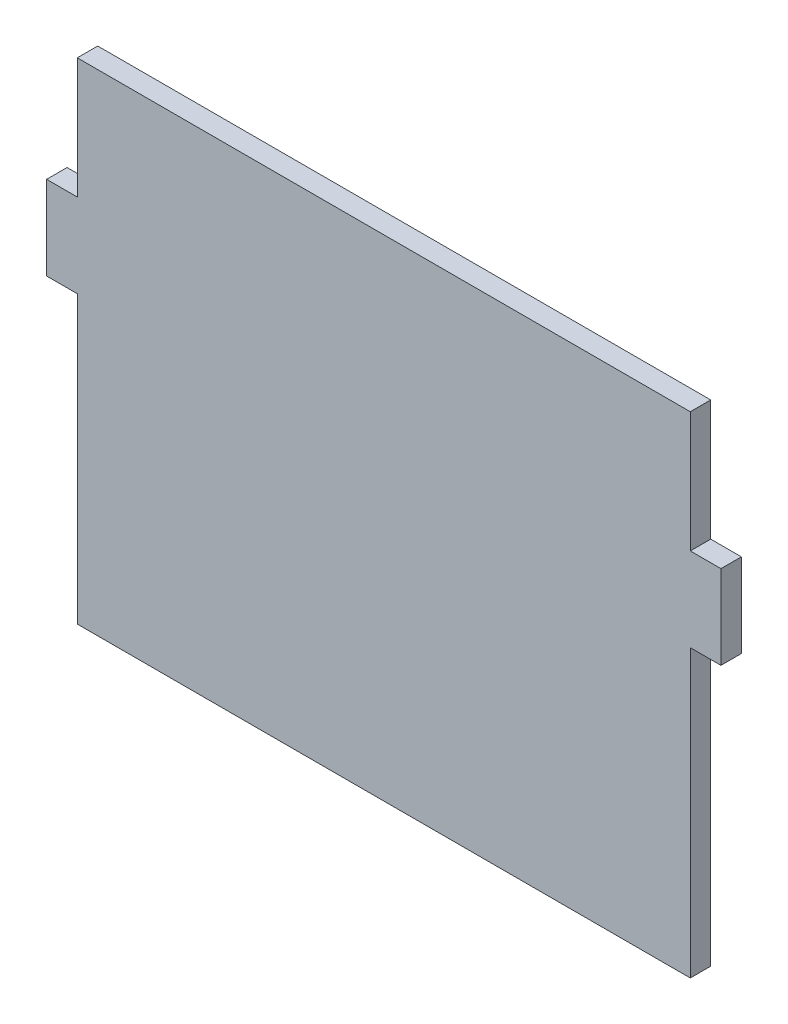
ISO-10303-21;
HEADER;
FILE_DESCRIPTION(('STEP AP214'),'2;1');
FILE_NAME('part.step','',(''),(''),'','','');
FILE_SCHEMA(('AUTOMOTIVE_DESIGN { 1 0 10303 214 1 1 1 1 }'));
ENDSEC;
DATA;
#1=APPLICATION_CONTEXT('core data for automotive mechanical design processes');
#2=APPLICATION_PROTOCOL_DEFINITION('international standard','automotive_design',2000,#1);
#3=PRODUCT_CONTEXT('',#1,'mechanical');
#4=PRODUCT('Part','Part','',(#3));
#5=PRODUCT_RELATED_PRODUCT_CATEGORY('part','',(#4));
#6=PRODUCT_DEFINITION_FORMATION('','',#4);
#7=PRODUCT_DEFINITION_CONTEXT('part definition',#1,'design');
#8=PRODUCT_DEFINITION('design','',#6,#7);
#9=PRODUCT_DEFINITION_SHAPE('','',#8);
#10=(LENGTH_UNIT() NAMED_UNIT(*) SI_UNIT(.MILLI.,.METRE.));
#11=(NAMED_UNIT(*) PLANE_ANGLE_UNIT() SI_UNIT($,.RADIAN.));
#12=(NAMED_UNIT(*) SI_UNIT($,.STERADIAN.) SOLID_ANGLE_UNIT());
#13=UNCERTAINTY_MEASURE_WITH_UNIT(LENGTH_MEASURE(1.E-05),#10,'distance_accuracy_value','');
#14=(GEOMETRIC_REPRESENTATION_CONTEXT(3) GLOBAL_UNCERTAINTY_ASSIGNED_CONTEXT((#13)) GLOBAL_UNIT_ASSIGNED_CONTEXT((#10,
#11,#12)) REPRESENTATION_CONTEXT('',''));
#15=CARTESIAN_POINT('',(0.,0.,0.));
#16=DIRECTION('',(0.,0.,1.));
#17=DIRECTION('',(1.,0.,0.));
#18=AXIS2_PLACEMENT_3D('',#15,#16,#17);
#19=CARTESIAN_POINT('',(150.,120.,10.));
#20=DIRECTION('',(-1.,0.,0.));
#21=DIRECTION('',(0.,-1.,0.));
#22=AXIS2_PLACEMENT_3D('',#19,#20,#21);
#23=PLANE('',#22);
#24=DIRECTION('',(0.,1.,0.));
#25=VECTOR('',#24,1.);
#26=CARTESIAN_POINT('',(150.,120.,0.));
#27=LINE('',#26,#25);
#28=CARTESIAN_POINT('',(150.,61.,0.));
#29=VERTEX_POINT('',#28);
#30=CARTESIAN_POINT('',(150.,120.,0.));
#31=VERTEX_POINT('',#30);
#32=EDGE_CURVE('E154',#29,#31,#27,.T.);
#33=ORIENTED_EDGE('',*,*,#32,.T.);
#34=DIRECTION('',(0.,0.,-1.));
#35=VECTOR('',#34,1.);
#36=CARTESIAN_POINT('',(150.,120.,10.));
#37=LINE('',#36,#35);
#38=CARTESIAN_POINT('',(150.,120.,10.));
#39=VERTEX_POINT('',#38);
#40=EDGE_CURVE('E11',#39,#31,#37,.T.);
#41=ORIENTED_EDGE('',*,*,#40,.F.);
#42=DIRECTION('',(0.,1.,0.));
#43=VECTOR('',#42,1.);
#44=CARTESIAN_POINT('',(150.,120.,10.));
#45=LINE('',#44,#43);
#46=CARTESIAN_POINT('',(150.,61.,10.));
#47=VERTEX_POINT('',#46);
#48=EDGE_CURVE('E176',#47,#39,#45,.T.);
#49=ORIENTED_EDGE('',*,*,#48,.F.);
#50=DIRECTION('',(0.,0.,-1.));
#51=VECTOR('',#50,1.);
#52=CARTESIAN_POINT('',(150.,61.,10.));
#53=LINE('',#52,#51);
#54=EDGE_CURVE('E150',#47,#29,#53,.T.);
#55=ORIENTED_EDGE('',*,*,#54,.T.);
#56=EDGE_LOOP('',(#33,#41,#49,#55));
#57=FACE_BOUND('',#56,.T.);
#58=ADVANCED_FACE('F34',(#57),#23,.F.);
#59=CARTESIAN_POINT('',(-150.,120.,10.));
#60=DIRECTION('',(0.,-1.,0.));
#61=DIRECTION('',(0.,0.,-1.));
#62=AXIS2_PLACEMENT_3D('',#59,#60,#61);
#63=PLANE('',#62);
#64=DIRECTION('',(-1.,0.,0.));
#65=VECTOR('',#64,1.);
#66=CARTESIAN_POINT('',(-150.,120.,0.));
#67=LINE('',#66,#65);
#68=CARTESIAN_POINT('',(-150.,120.,0.));
#69=VERTEX_POINT('',#68);
#70=EDGE_CURVE('E157',#31,#69,#67,.T.);
#71=ORIENTED_EDGE('',*,*,#70,.T.);
#72=DIRECTION('',(0.,0.,-1.));
#73=VECTOR('',#72,1.);
#74=CARTESIAN_POINT('',(-150.,120.,10.));
#75=LINE('',#74,#73);
#76=CARTESIAN_POINT('',(-150.,120.,10.));
#77=VERTEX_POINT('',#76);
#78=EDGE_CURVE('E42',#77,#69,#75,.T.);
#79=ORIENTED_EDGE('',*,*,#78,.F.);
#80=DIRECTION('',(-1.,0.,0.));
#81=VECTOR('',#80,1.);
#82=CARTESIAN_POINT('',(-150.,120.,10.));
#83=LINE('',#82,#81);
#84=EDGE_CURVE('E105',#39,#77,#83,.T.);
#85=ORIENTED_EDGE('',*,*,#84,.F.);
#86=ORIENTED_EDGE('',*,*,#40,.T.);
#87=EDGE_LOOP('',(#71,#79,#85,#86));
#88=FACE_BOUND('',#87,.T.);
#89=ADVANCED_FACE('F254',(#88),#63,.F.);
#90=CARTESIAN_POINT('',(-150.,61.,10.));
#91=DIRECTION('',(1.,0.,0.));
#92=DIRECTION('',(0.,1.,0.));
#93=AXIS2_PLACEMENT_3D('',#90,#91,#92);
#94=PLANE('',#93);
#95=DIRECTION('',(0.,-1.,0.));
#96=VECTOR('',#95,1.);
#97=CARTESIAN_POINT('',(-150.,61.,0.));
#98=LINE('',#97,#96);
#99=CARTESIAN_POINT('',(-150.,61.,0.));
#100=VERTEX_POINT('',#99);
#101=EDGE_CURVE('E159',#69,#100,#98,.T.);
#102=ORIENTED_EDGE('',*,*,#101,.T.);
#103=DIRECTION('',(0.,0.,-1.));
#104=VECTOR('',#103,1.);
#105=CARTESIAN_POINT('',(-150.,61.,10.));
#106=LINE('',#105,#104);
#107=CARTESIAN_POINT('',(-150.,61.,10.));
#108=VERTEX_POINT('',#107);
#109=EDGE_CURVE('E195',#108,#100,#106,.T.);
#110=ORIENTED_EDGE('',*,*,#109,.F.);
#111=DIRECTION('',(0.,-1.,0.));
#112=VECTOR('',#111,1.);
#113=CARTESIAN_POINT('',(-150.,61.,10.));
#114=LINE('',#113,#112);
#115=EDGE_CURVE('E203',#77,#108,#114,.T.);
#116=ORIENTED_EDGE('',*,*,#115,.F.);
#117=ORIENTED_EDGE('',*,*,#78,.T.);
#118=EDGE_LOOP('',(#102,#110,#116,#117));
#119=FACE_BOUND('',#118,.T.);
#120=ADVANCED_FACE('F201',(#119),#94,.F.);
#121=CARTESIAN_POINT('',(-165.,61.,10.));
#122=DIRECTION('',(0.,-1.,0.));
#123=DIRECTION('',(0.,0.,-1.));
#124=AXIS2_PLACEMENT_3D('',#121,#122,#123);
#125=PLANE('',#124);
#126=DIRECTION('',(-1.,0.,0.));
#127=VECTOR('',#126,1.);
#128=CARTESIAN_POINT('',(-165.,61.,0.));
#129=LINE('',#128,#127);
#130=CARTESIAN_POINT('',(-165.,61.,0.));
#131=VERTEX_POINT('',#130);
#132=EDGE_CURVE('E161',#100,#131,#129,.T.);
#133=ORIENTED_EDGE('',*,*,#132,.T.);
#134=DIRECTION('',(0.,0.,-1.));
#135=VECTOR('',#134,1.);
#136=CARTESIAN_POINT('',(-165.,61.,10.));
#137=LINE('',#136,#135);
#138=CARTESIAN_POINT('',(-165.,61.,10.));
#139=VERTEX_POINT('',#138);
#140=EDGE_CURVE('E192',#139,#131,#137,.T.);
#141=ORIENTED_EDGE('',*,*,#140,.F.);
#142=DIRECTION('',(-1.,0.,0.));
#143=VECTOR('',#142,1.);
#144=CARTESIAN_POINT('',(-165.,61.,10.));
#145=LINE('',#144,#143);
#146=EDGE_CURVE('E221',#108,#139,#145,.T.);
#147=ORIENTED_EDGE('',*,*,#146,.F.);
#148=ORIENTED_EDGE('',*,*,#109,.T.);
#149=EDGE_LOOP('',(#133,#141,#147,#148));
#150=FACE_BOUND('',#149,.T.);
#151=ADVANCED_FACE('F212',(#150),#125,.F.);
#152=CARTESIAN_POINT('',(-165.,20.,10.));
#153=DIRECTION('',(1.,0.,0.));
#154=DIRECTION('',(0.,1.,0.));
#155=AXIS2_PLACEMENT_3D('',#152,#153,#154);
#156=PLANE('',#155);
#157=DIRECTION('',(0.,-1.,0.));
#158=VECTOR('',#157,1.);
#159=CARTESIAN_POINT('',(-165.,20.,0.));
#160=LINE('',#159,#158);
#161=CARTESIAN_POINT('',(-165.,20.,0.));
#162=VERTEX_POINT('',#161);
#163=EDGE_CURVE('E163',#131,#162,#160,.T.);
#164=ORIENTED_EDGE('',*,*,#163,.T.);
#165=DIRECTION('',(0.,0.,-1.));
#166=VECTOR('',#165,1.);
#167=CARTESIAN_POINT('',(-165.,20.,10.));
#168=LINE('',#167,#166);
#169=CARTESIAN_POINT('',(-165.,20.,10.));
#170=VERTEX_POINT('',#169);
#171=EDGE_CURVE('E189',#170,#162,#168,.T.);
#172=ORIENTED_EDGE('',*,*,#171,.F.);
#173=DIRECTION('',(0.,-1.,0.));
#174=VECTOR('',#173,1.);
#175=CARTESIAN_POINT('',(-165.,20.,10.));
#176=LINE('',#175,#174);
#177=EDGE_CURVE('E218',#139,#170,#176,.T.);
#178=ORIENTED_EDGE('',*,*,#177,.F.);
#179=ORIENTED_EDGE('',*,*,#140,.T.);
#180=EDGE_LOOP('',(#164,#172,#178,#179));
#181=FACE_BOUND('',#180,.T.);
#182=ADVANCED_FACE('F216',(#181),#156,.F.);
#183=CARTESIAN_POINT('',(-150.,20.,10.));
#184=DIRECTION('',(0.,1.,0.));
#185=DIRECTION('',(0.,0.,1.));
#186=AXIS2_PLACEMENT_3D('',#183,#184,#185);
#187=PLANE('',#186);
#188=DIRECTION('',(1.,0.,0.));
#189=VECTOR('',#188,1.);
#190=CARTESIAN_POINT('',(-150.,20.,0.));
#191=LINE('',#190,#189);
#192=CARTESIAN_POINT('',(-150.,20.,0.));
#193=VERTEX_POINT('',#192);
#194=EDGE_CURVE('E165',#162,#193,#191,.T.);
#195=ORIENTED_EDGE('',*,*,#194,.T.);
#196=DIRECTION('',(0.,0.,-1.));
#197=VECTOR('',#196,1.);
#198=CARTESIAN_POINT('',(-150.,20.,10.));
#199=LINE('',#198,#197);
#200=CARTESIAN_POINT('',(-150.,20.,10.));
#201=VERTEX_POINT('',#200);
#202=EDGE_CURVE('E186',#201,#193,#199,.T.);
#203=ORIENTED_EDGE('',*,*,#202,.F.);
#204=DIRECTION('',(1.,0.,0.));
#205=VECTOR('',#204,1.);
#206=CARTESIAN_POINT('',(-150.,20.,10.));
#207=LINE('',#206,#205);
#208=EDGE_CURVE('E220',#170,#201,#207,.T.);
#209=ORIENTED_EDGE('',*,*,#208,.F.);
#210=ORIENTED_EDGE('',*,*,#171,.T.);
#211=EDGE_LOOP('',(#195,#203,#209,#210));
#212=FACE_BOUND('',#211,.T.);
#213=ADVANCED_FACE('F267',(#212),#187,.F.);
#214=CARTESIAN_POINT('',(-150.,-120.,10.));
#215=DIRECTION('',(1.,0.,0.));
#216=DIRECTION('',(0.,0.,-1.));
#217=AXIS2_PLACEMENT_3D('',#214,#215,#216);
#218=PLANE('',#217);
#219=DIRECTION('',(0.,-1.,0.));
#220=VECTOR('',#219,1.);
#221=CARTESIAN_POINT('',(-150.,-120.,0.));
#222=LINE('',#221,#220);
#223=CARTESIAN_POINT('',(-150.,-120.,0.));
#224=VERTEX_POINT('',#223);
#225=EDGE_CURVE('E167',#193,#224,#222,.T.);
#226=ORIENTED_EDGE('',*,*,#225,.T.);
#227=DIRECTION('',(0.,0.,-1.));
#228=VECTOR('',#227,1.);
#229=CARTESIAN_POINT('',(-150.,-120.,10.));
#230=LINE('',#229,#228);
#231=CARTESIAN_POINT('',(-150.,-120.,10.));
#232=VERTEX_POINT('',#231);
#233=EDGE_CURVE('E183',#232,#224,#230,.T.);
#234=ORIENTED_EDGE('',*,*,#233,.F.);
#235=DIRECTION('',(0.,-1.,0.));
#236=VECTOR('',#235,1.);
#237=CARTESIAN_POINT('',(-150.,-120.,10.));
#238=LINE('',#237,#236);
#239=EDGE_CURVE('E223',#201,#232,#238,.T.);
#240=ORIENTED_EDGE('',*,*,#239,.F.);
#241=ORIENTED_EDGE('',*,*,#202,.T.);
#242=EDGE_LOOP('',(#226,#234,#240,#241));
#243=FACE_BOUND('',#242,.T.);
#244=ADVANCED_FACE('F270',(#243),#218,.F.);
#245=CARTESIAN_POINT('',(150.,-120.,10.));
#246=DIRECTION('',(0.,1.,0.));
#247=DIRECTION('',(0.,0.,1.));
#248=AXIS2_PLACEMENT_3D('',#245,#246,#247);
#249=PLANE('',#248);
#250=DIRECTION('',(1.,0.,0.));
#251=VECTOR('',#250,1.);
#252=CARTESIAN_POINT('',(150.,-120.,0.));
#253=LINE('',#252,#251);
#254=CARTESIAN_POINT('',(150.,-120.,0.));
#255=VERTEX_POINT('',#254);
#256=EDGE_CURVE('E169',#224,#255,#253,.T.);
#257=ORIENTED_EDGE('',*,*,#256,.T.);
#258=DIRECTION('',(0.,0.,-1.));
#259=VECTOR('',#258,1.);
#260=CARTESIAN_POINT('',(150.,-120.,10.));
#261=LINE('',#260,#259);
#262=CARTESIAN_POINT('',(150.,-120.,10.));
#263=VERTEX_POINT('',#262);
#264=EDGE_CURVE('E180',#263,#255,#261,.T.);
#265=ORIENTED_EDGE('',*,*,#264,.F.);
#266=DIRECTION('',(1.,0.,0.));
#267=VECTOR('',#266,1.);
#268=CARTESIAN_POINT('',(150.,-120.,10.));
#269=LINE('',#268,#267);
#270=EDGE_CURVE('E229',#232,#263,#269,.T.);
#271=ORIENTED_EDGE('',*,*,#270,.F.);
#272=ORIENTED_EDGE('',*,*,#233,.T.);
#273=EDGE_LOOP('',(#257,#265,#271,#272));
#274=FACE_BOUND('',#273,.T.);
#275=ADVANCED_FACE('F235',(#274),#249,.F.);
#276=CARTESIAN_POINT('',(150.,20.,10.));
#277=DIRECTION('',(-1.,0.,0.));
#278=DIRECTION('',(0.,0.,1.));
#279=AXIS2_PLACEMENT_3D('',#276,#277,#278);
#280=PLANE('',#279);
#281=DIRECTION('',(0.,1.,0.));
#282=VECTOR('',#281,1.);
#283=CARTESIAN_POINT('',(150.,20.,0.));
#284=LINE('',#283,#282);
#285=CARTESIAN_POINT('',(150.,20.,0.));
#286=VERTEX_POINT('',#285);
#287=EDGE_CURVE('E171',#255,#286,#284,.T.);
#288=ORIENTED_EDGE('',*,*,#287,.T.);
#289=DIRECTION('',(0.,0.,-1.));
#290=VECTOR('',#289,1.);
#291=CARTESIAN_POINT('',(150.,20.,10.));
#292=LINE('',#291,#290);
#293=CARTESIAN_POINT('',(150.,20.,10.));
#294=VERTEX_POINT('',#293);
#295=EDGE_CURVE('E145',#294,#286,#292,.T.);
#296=ORIENTED_EDGE('',*,*,#295,.F.);
#297=DIRECTION('',(0.,1.,0.));
#298=VECTOR('',#297,1.);
#299=CARTESIAN_POINT('',(150.,20.,10.));
#300=LINE('',#299,#298);
#301=EDGE_CURVE('E136',#263,#294,#300,.T.);
#302=ORIENTED_EDGE('',*,*,#301,.F.);
#303=ORIENTED_EDGE('',*,*,#264,.T.);
#304=EDGE_LOOP('',(#288,#296,#302,#303));
#305=FACE_BOUND('',#304,.T.);
#306=ADVANCED_FACE('F239',(#305),#280,.F.);
#307=CARTESIAN_POINT('',(165.,20.,10.));
#308=DIRECTION('',(0.,1.,0.));
#309=DIRECTION('',(-1.,0.,0.));
#310=AXIS2_PLACEMENT_3D('',#307,#308,#309);
#311=PLANE('',#310);
#312=DIRECTION('',(1.,0.,0.));
#313=VECTOR('',#312,1.);
#314=CARTESIAN_POINT('',(165.,20.,0.));
#315=LINE('',#314,#313);
#316=CARTESIAN_POINT('',(165.,20.,0.));
#317=VERTEX_POINT('',#316);
#318=EDGE_CURVE('E144',#286,#317,#315,.T.);
#319=ORIENTED_EDGE('',*,*,#318,.T.);
#320=DIRECTION('',(0.,0.,-1.));
#321=VECTOR('',#320,1.);
#322=CARTESIAN_POINT('',(165.,20.,10.));
#323=LINE('',#322,#321);
#324=CARTESIAN_POINT('',(165.,20.,10.));
#325=VERTEX_POINT('',#324);
#326=EDGE_CURVE('E141',#325,#317,#323,.T.);
#327=ORIENTED_EDGE('',*,*,#326,.F.);
#328=DIRECTION('',(1.,0.,0.));
#329=VECTOR('',#328,1.);
#330=CARTESIAN_POINT('',(165.,20.,10.));
#331=LINE('',#330,#329);
#332=EDGE_CURVE('E130',#294,#325,#331,.T.);
#333=ORIENTED_EDGE('',*,*,#332,.F.);
#334=ORIENTED_EDGE('',*,*,#295,.T.);
#335=EDGE_LOOP('',(#319,#327,#333,#334));
#336=FACE_BOUND('',#335,.T.);
#337=ADVANCED_FACE('F142',(#336),#311,.F.);
#338=CARTESIAN_POINT('',(165.,61.,10.));
#339=DIRECTION('',(-1.,0.,0.));
#340=DIRECTION('',(0.,-1.,0.));
#341=AXIS2_PLACEMENT_3D('',#338,#339,#340);
#342=PLANE('',#341);
#343=DIRECTION('',(0.,1.,0.));
#344=VECTOR('',#343,1.);
#345=CARTESIAN_POINT('',(165.,61.,0.));
#346=LINE('',#345,#344);
#347=CARTESIAN_POINT('',(165.,61.,0.));
#348=VERTEX_POINT('',#347);
#349=EDGE_CURVE('E91',#317,#348,#346,.T.);
#350=ORIENTED_EDGE('',*,*,#349,.T.);
#351=DIRECTION('',(0.,0.,-1.));
#352=VECTOR('',#351,1.);
#353=CARTESIAN_POINT('',(165.,61.,10.));
#354=LINE('',#353,#352);
#355=CARTESIAN_POINT('',(165.,61.,10.));
#356=VERTEX_POINT('',#355);
#357=EDGE_CURVE('E146',#356,#348,#354,.T.);
#358=ORIENTED_EDGE('',*,*,#357,.F.);
#359=DIRECTION('',(0.,1.,0.));
#360=VECTOR('',#359,1.);
#361=CARTESIAN_POINT('',(165.,61.,10.));
#362=LINE('',#361,#360);
#363=EDGE_CURVE('E134',#325,#356,#362,.T.);
#364=ORIENTED_EDGE('',*,*,#363,.F.);
#365=ORIENTED_EDGE('',*,*,#326,.T.);
#366=EDGE_LOOP('',(#350,#358,#364,#365));
#367=FACE_BOUND('',#366,.T.);
#368=ADVANCED_FACE('F148',(#367),#342,.F.);
#369=CARTESIAN_POINT('',(150.,61.,10.));
#370=DIRECTION('',(0.,-1.,0.));
#371=DIRECTION('',(0.,0.,-1.));
#372=AXIS2_PLACEMENT_3D('',#369,#370,#371);
#373=PLANE('',#372);
#374=DIRECTION('',(-1.,0.,0.));
#375=VECTOR('',#374,1.);
#376=CARTESIAN_POINT('',(150.,61.,0.));
#377=LINE('',#376,#375);
#378=EDGE_CURVE('E97',#348,#29,#377,.T.);
#379=ORIENTED_EDGE('',*,*,#378,.T.);
#380=ORIENTED_EDGE('',*,*,#54,.F.);
#381=DIRECTION('',(-1.,0.,0.));
#382=VECTOR('',#381,1.);
#383=CARTESIAN_POINT('',(150.,61.,10.));
#384=LINE('',#383,#382);
#385=EDGE_CURVE('E50',#356,#47,#384,.T.);
#386=ORIENTED_EDGE('',*,*,#385,.F.);
#387=ORIENTED_EDGE('',*,*,#357,.T.);
#388=EDGE_LOOP('',(#379,#380,#386,#387));
#389=FACE_BOUND('',#388,.T.);
#390=ADVANCED_FACE('F243',(#389),#373,.F.);
#391=CARTESIAN_POINT('',(0.,0.,10.));
#392=DIRECTION('',(0.,0.,1.));
#393=DIRECTION('',(1.,0.,0.));
#394=AXIS2_PLACEMENT_3D('',#391,#392,#393);
#395=PLANE('',#394);
#396=ORIENTED_EDGE('',*,*,#48,.T.);
#397=ORIENTED_EDGE('',*,*,#84,.T.);
#398=ORIENTED_EDGE('',*,*,#115,.T.);
#399=ORIENTED_EDGE('',*,*,#146,.T.);
#400=ORIENTED_EDGE('',*,*,#177,.T.);
#401=ORIENTED_EDGE('',*,*,#208,.T.);
#402=ORIENTED_EDGE('',*,*,#239,.T.);
#403=ORIENTED_EDGE('',*,*,#270,.T.);
#404=ORIENTED_EDGE('',*,*,#301,.T.);
#405=ORIENTED_EDGE('',*,*,#332,.T.);
#406=ORIENTED_EDGE('',*,*,#363,.T.);
#407=ORIENTED_EDGE('',*,*,#385,.T.);
#408=EDGE_LOOP('',(#396,#397,#398,#399,#400,#401,#402,#403,#404,#405,#406,#407));
#409=FACE_BOUND('',#408,.T.);
#410=ADVANCED_FACE('F132',(#409),#395,.T.);
#411=CARTESIAN_POINT('',(0.,0.,0.));
#412=DIRECTION('',(0.,0.,1.));
#413=DIRECTION('',(1.,0.,0.));
#414=AXIS2_PLACEMENT_3D('',#411,#412,#413);
#415=PLANE('',#414);
#416=ORIENTED_EDGE('',*,*,#32,.F.);
#417=ORIENTED_EDGE('',*,*,#378,.F.);
#418=ORIENTED_EDGE('',*,*,#349,.F.);
#419=ORIENTED_EDGE('',*,*,#318,.F.);
#420=ORIENTED_EDGE('',*,*,#287,.F.);
#421=ORIENTED_EDGE('',*,*,#256,.F.);
#422=ORIENTED_EDGE('',*,*,#225,.F.);
#423=ORIENTED_EDGE('',*,*,#194,.F.);
#424=ORIENTED_EDGE('',*,*,#163,.F.);
#425=ORIENTED_EDGE('',*,*,#132,.F.);
#426=ORIENTED_EDGE('',*,*,#101,.F.);
#427=ORIENTED_EDGE('',*,*,#70,.F.);
#428=EDGE_LOOP('',(#416,#417,#418,#419,#420,#421,#422,#423,#424,#425,#426,#427));
#429=FACE_BOUND('',#428,.T.);
#430=ADVANCED_FACE('F207',(#429),#415,.F.);
#431=CLOSED_SHELL('',(#58,#89,#120,#151,#182,#213,#244,#275,#306,#337,#368,#390,#410,#430));
#432=MANIFOLD_SOLID_BREP('B2',#431);
#433=ADVANCED_BREP_SHAPE_REPRESENTATION('',(#18,#432),#14);
#434=SHAPE_DEFINITION_REPRESENTATION(#9,#433);
ENDSEC;
END-ISO-10303-21;
